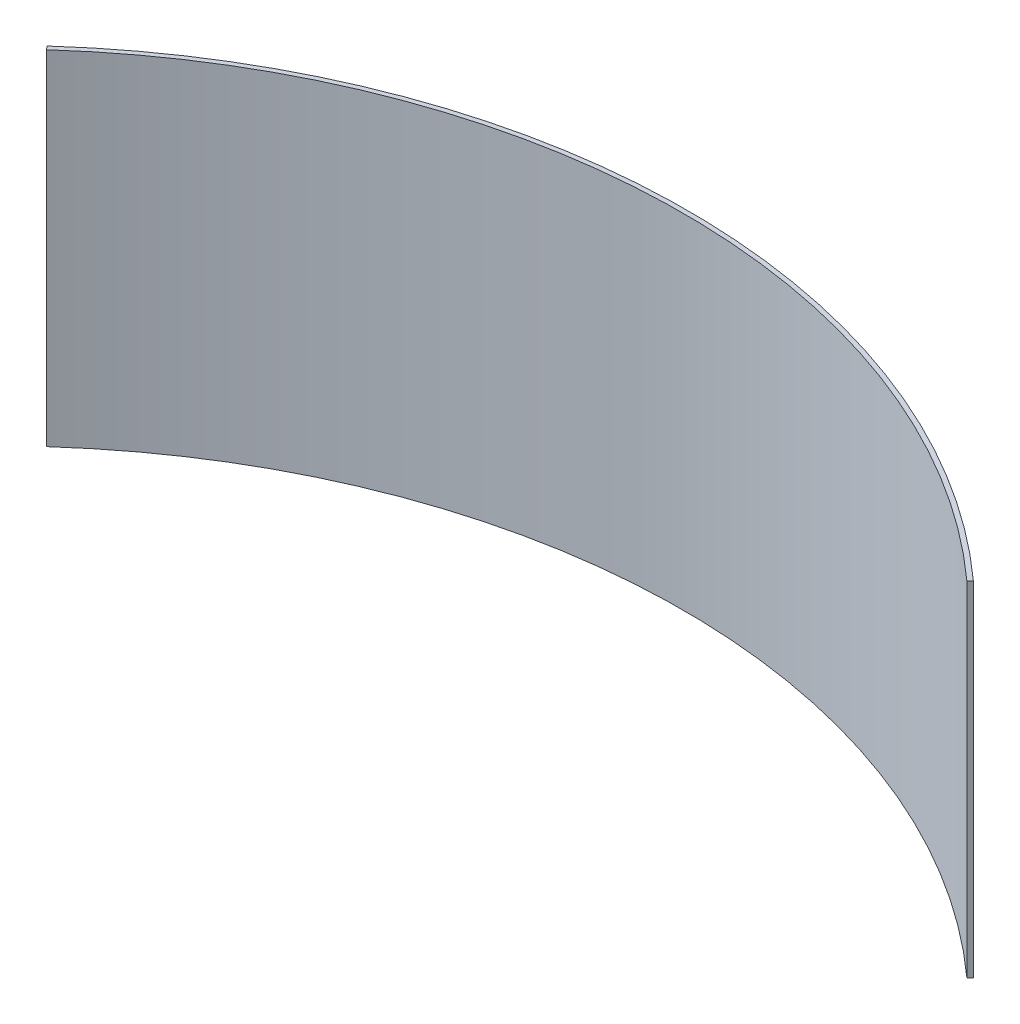
ISO-10303-21;
HEADER;
FILE_DESCRIPTION(('STEP AP214'),'2;1');
FILE_NAME('part.step','',(''),(''),'','','');
FILE_SCHEMA(('AUTOMOTIVE_DESIGN { 1 0 10303 214 1 1 1 1 }'));
ENDSEC;
DATA;
#1=APPLICATION_CONTEXT('core data for automotive mechanical design processes');
#2=APPLICATION_PROTOCOL_DEFINITION('international standard','automotive_design',2000,#1);
#3=PRODUCT_CONTEXT('',#1,'mechanical');
#4=PRODUCT('Part','Part','',(#3));
#5=PRODUCT_RELATED_PRODUCT_CATEGORY('part','',(#4));
#6=PRODUCT_DEFINITION_FORMATION('','',#4);
#7=PRODUCT_DEFINITION_CONTEXT('part definition',#1,'design');
#8=PRODUCT_DEFINITION('design','',#6,#7);
#9=PRODUCT_DEFINITION_SHAPE('','',#8);
#10=(LENGTH_UNIT() NAMED_UNIT(*) SI_UNIT(.MILLI.,.METRE.));
#11=(NAMED_UNIT(*) PLANE_ANGLE_UNIT() SI_UNIT($,.RADIAN.));
#12=(NAMED_UNIT(*) SI_UNIT($,.STERADIAN.) SOLID_ANGLE_UNIT());
#13=UNCERTAINTY_MEASURE_WITH_UNIT(LENGTH_MEASURE(1.E-05),#10,'distance_accuracy_value','');
#14=(GEOMETRIC_REPRESENTATION_CONTEXT(3) GLOBAL_UNCERTAINTY_ASSIGNED_CONTEXT((#13)) GLOBAL_UNIT_ASSIGNED_CONTEXT((#10,
#11,#12)) REPRESENTATION_CONTEXT('',''));
#15=CARTESIAN_POINT('',(0.,0.,0.));
#16=DIRECTION('',(0.,0.,1.));
#17=DIRECTION('',(1.,0.,0.));
#18=AXIS2_PLACEMENT_3D('',#15,#16,#17);
#19=CARTESIAN_POINT('',(0.,7.5,0.));
#20=DIRECTION('',(0.,-1.,0.));
#21=DIRECTION('',(0.,0.,-1.));
#22=AXIS2_PLACEMENT_3D('',#19,#20,#21);
#23=CYLINDRICAL_SURFACE('',#22,30.);
#24=CARTESIAN_POINT('',(0.,-7.5,0.));
#25=DIRECTION('',(0.,-1.,0.));
#26=DIRECTION('',(0.,0.,1.));
#27=AXIS2_PLACEMENT_3D('',#24,#25,#26);
#28=CIRCLE('',#27,30.);
#29=CARTESIAN_POINT('',(-20.080495207514,-7.5,-22.2884210347213));
#30=VERTEX_POINT('',#29);
#31=CARTESIAN_POINT('',(20.080495207514,-7.5,-22.2884210347213));
#32=VERTEX_POINT('',#31);
#33=EDGE_CURVE('E109',#30,#32,#28,.T.);
#34=ORIENTED_EDGE('',*,*,#33,.T.);
#35=DIRECTION('',(0.,-1.,0.));
#36=VECTOR('',#35,1.);
#37=CARTESIAN_POINT('',(20.080495207514,7.5,-22.2884210347213));
#38=LINE('',#37,#36);
#39=CARTESIAN_POINT('',(20.080495207514,7.5,-22.2884210347213));
#40=VERTEX_POINT('',#39);
#41=EDGE_CURVE('E11',#40,#32,#38,.T.);
#42=ORIENTED_EDGE('',*,*,#41,.F.);
#43=CARTESIAN_POINT('',(0.,7.5,0.));
#44=DIRECTION('',(0.,-1.,0.));
#45=DIRECTION('',(0.,0.,1.));
#46=AXIS2_PLACEMENT_3D('',#43,#44,#45);
#47=CIRCLE('',#46,30.);
#48=CARTESIAN_POINT('',(-20.080495207514,7.5,-22.2884210347213));
#49=VERTEX_POINT('',#48);
#50=EDGE_CURVE('E93',#49,#40,#47,.T.);
#51=ORIENTED_EDGE('',*,*,#50,.F.);
#52=DIRECTION('',(0.,-1.,0.));
#53=VECTOR('',#52,1.);
#54=CARTESIAN_POINT('',(-20.080495207514,7.5,-22.2884210347213));
#55=LINE('',#54,#53);
#56=EDGE_CURVE('E105',#49,#30,#55,.T.);
#57=ORIENTED_EDGE('',*,*,#56,.T.);
#58=EDGE_LOOP('',(#34,#42,#51,#57));
#59=FACE_BOUND('',#58,.T.);
#60=ADVANCED_FACE('F41',(#59),#23,.F.);
#61=CARTESIAN_POINT('',(20.214365175564,7.5,-22.4370105082862));
#62=DIRECTION('',(-0.742947367824038,0.,-0.669349840250473));
#63=DIRECTION('',(-0.669349840250473,0.,0.742947367824038));
#64=AXIS2_PLACEMENT_3D('',#61,#62,#63);
#65=PLANE('',#64);
#66=DIRECTION('',(0.669349840250473,0.,-0.742947367824038));
#67=VECTOR('',#66,1.);
#68=CARTESIAN_POINT('',(20.214365175564,-7.5,-22.4370105082862));
#69=LINE('',#68,#67);
#70=CARTESIAN_POINT('',(20.214365175564,-7.5,-22.4370105082862));
#71=VERTEX_POINT('',#70);
#72=EDGE_CURVE('E98',#32,#71,#69,.T.);
#73=ORIENTED_EDGE('',*,*,#72,.T.);
#74=DIRECTION('',(0.,-1.,0.));
#75=VECTOR('',#74,1.);
#76=CARTESIAN_POINT('',(20.214365175564,7.5,-22.4370105082862));
#77=LINE('',#76,#75);
#78=CARTESIAN_POINT('',(20.214365175564,7.5,-22.4370105082862));
#79=VERTEX_POINT('',#78);
#80=EDGE_CURVE('E50',#79,#71,#77,.T.);
#81=ORIENTED_EDGE('',*,*,#80,.F.);
#82=DIRECTION('',(0.669349840250473,0.,-0.742947367824038));
#83=VECTOR('',#82,1.);
#84=CARTESIAN_POINT('',(20.214365175564,7.5,-22.4370105082862));
#85=LINE('',#84,#83);
#86=EDGE_CURVE('E88',#40,#79,#85,.T.);
#87=ORIENTED_EDGE('',*,*,#86,.F.);
#88=ORIENTED_EDGE('',*,*,#41,.T.);
#89=EDGE_LOOP('',(#73,#81,#87,#88));
#90=FACE_BOUND('',#89,.T.);
#91=ADVANCED_FACE('F97',(#90),#65,.F.);
#92=CARTESIAN_POINT('',(0.,7.5,0.));
#93=DIRECTION('',(0.,-1.,0.));
#94=DIRECTION('',(0.,0.,-1.));
#95=AXIS2_PLACEMENT_3D('',#92,#93,#94);
#96=CYLINDRICAL_SURFACE('',#95,30.2);
#97=CARTESIAN_POINT('',(0.,-7.5,0.));
#98=DIRECTION('',(0.,1.,0.));
#99=DIRECTION('',(0.,0.,1.));
#100=AXIS2_PLACEMENT_3D('',#97,#98,#99);
#101=CIRCLE('',#100,30.2);
#102=CARTESIAN_POINT('',(-20.214365175564,-7.5,-22.4370105082862));
#103=VERTEX_POINT('',#102);
#104=EDGE_CURVE('E75',#71,#103,#101,.T.);
#105=ORIENTED_EDGE('',*,*,#104,.T.);
#106=DIRECTION('',(0.,-1.,0.));
#107=VECTOR('',#106,1.);
#108=CARTESIAN_POINT('',(-20.214365175564,7.5,-22.4370105082862));
#109=LINE('',#108,#107);
#110=CARTESIAN_POINT('',(-20.214365175564,7.5,-22.4370105082862));
#111=VERTEX_POINT('',#110);
#112=EDGE_CURVE('E100',#111,#103,#109,.T.);
#113=ORIENTED_EDGE('',*,*,#112,.F.);
#114=CARTESIAN_POINT('',(0.,7.5,0.));
#115=DIRECTION('',(0.,1.,0.));
#116=DIRECTION('',(0.,0.,1.));
#117=AXIS2_PLACEMENT_3D('',#114,#115,#116);
#118=CIRCLE('',#117,30.2);
#119=EDGE_CURVE('E91',#79,#111,#118,.T.);
#120=ORIENTED_EDGE('',*,*,#119,.F.);
#121=ORIENTED_EDGE('',*,*,#80,.T.);
#122=EDGE_LOOP('',(#105,#113,#120,#121));
#123=FACE_BOUND('',#122,.T.);
#124=ADVANCED_FACE('F101',(#123),#96,.T.);
#125=CARTESIAN_POINT('',(-20.214365175564,7.5,-22.4370105082862));
#126=DIRECTION('',(0.742947367824038,0.,-0.669349840250473));
#127=DIRECTION('',(-0.669349840250473,0.,-0.742947367824038));
#128=AXIS2_PLACEMENT_3D('',#125,#126,#127);
#129=PLANE('',#128);
#130=DIRECTION('',(0.669349840250473,0.,0.742947367824038));
#131=VECTOR('',#130,1.);
#132=CARTESIAN_POINT('',(-20.214365175564,-7.5,-22.4370105082862));
#133=LINE('',#132,#131);
#134=EDGE_CURVE('E81',#103,#30,#133,.T.);
#135=ORIENTED_EDGE('',*,*,#134,.T.);
#136=ORIENTED_EDGE('',*,*,#56,.F.);
#137=DIRECTION('',(0.669349840250473,0.,0.742947367824038));
#138=VECTOR('',#137,1.);
#139=CARTESIAN_POINT('',(-20.214365175564,7.5,-22.4370105082862));
#140=LINE('',#139,#138);
#141=EDGE_CURVE('E58',#111,#49,#140,.T.);
#142=ORIENTED_EDGE('',*,*,#141,.F.);
#143=ORIENTED_EDGE('',*,*,#112,.T.);
#144=EDGE_LOOP('',(#135,#136,#142,#143));
#145=FACE_BOUND('',#144,.T.);
#146=ADVANCED_FACE('F122',(#145),#129,.F.);
#147=CARTESIAN_POINT('',(0.,7.5,0.));
#148=DIRECTION('',(0.,1.,0.));
#149=DIRECTION('',(0.,0.,1.));
#150=AXIS2_PLACEMENT_3D('',#147,#148,#149);
#151=PLANE('',#150);
#152=ORIENTED_EDGE('',*,*,#50,.T.);
#153=ORIENTED_EDGE('',*,*,#86,.T.);
#154=ORIENTED_EDGE('',*,*,#119,.T.);
#155=ORIENTED_EDGE('',*,*,#141,.T.);
#156=EDGE_LOOP('',(#152,#153,#154,#155));
#157=FACE_BOUND('',#156,.T.);
#158=ADVANCED_FACE('F89',(#157),#151,.T.);
#159=CARTESIAN_POINT('',(0.,-7.5,0.));
#160=DIRECTION('',(0.,1.,0.));
#161=DIRECTION('',(0.,0.,1.));
#162=AXIS2_PLACEMENT_3D('',#159,#160,#161);
#163=PLANE('',#162);
#164=ORIENTED_EDGE('',*,*,#33,.F.);
#165=ORIENTED_EDGE('',*,*,#134,.F.);
#166=ORIENTED_EDGE('',*,*,#104,.F.);
#167=ORIENTED_EDGE('',*,*,#72,.F.);
#168=EDGE_LOOP('',(#164,#165,#166,#167));
#169=FACE_BOUND('',#168,.T.);
#170=ADVANCED_FACE('F125',(#169),#163,.F.);
#171=CLOSED_SHELL('',(#60,#91,#124,#146,#158,#170));
#172=MANIFOLD_SOLID_BREP('B2',#171);
#173=ADVANCED_BREP_SHAPE_REPRESENTATION('',(#18,#172),#14);
#174=SHAPE_DEFINITION_REPRESENTATION(#9,#173);
ENDSEC;
END-ISO-10303-21;
